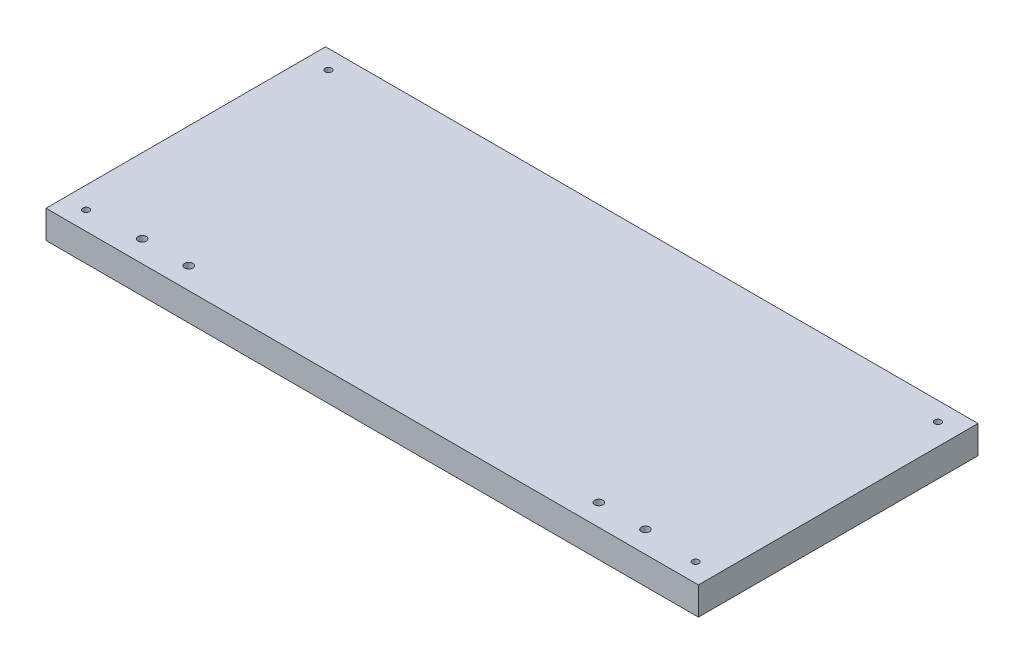
ISO-10303-21;
HEADER;
FILE_DESCRIPTION(('STEP AP214'),'2;1');
FILE_NAME('part.step','',(''),(''),'','','');
FILE_SCHEMA(('AUTOMOTIVE_DESIGN { 1 0 10303 214 1 1 1 1 }'));
ENDSEC;
DATA;
#1=APPLICATION_CONTEXT('core data for automotive mechanical design processes');
#2=APPLICATION_PROTOCOL_DEFINITION('international standard','automotive_design',2000,#1);
#3=PRODUCT_CONTEXT('',#1,'mechanical');
#4=PRODUCT('Part','Part','',(#3));
#5=PRODUCT_RELATED_PRODUCT_CATEGORY('part','',(#4));
#6=PRODUCT_DEFINITION_FORMATION('','',#4);
#7=PRODUCT_DEFINITION_CONTEXT('part definition',#1,'design');
#8=PRODUCT_DEFINITION('design','',#6,#7);
#9=PRODUCT_DEFINITION_SHAPE('','',#8);
#10=(LENGTH_UNIT() NAMED_UNIT(*) SI_UNIT(.MILLI.,.METRE.));
#11=(NAMED_UNIT(*) PLANE_ANGLE_UNIT() SI_UNIT($,.RADIAN.));
#12=(NAMED_UNIT(*) SI_UNIT($,.STERADIAN.) SOLID_ANGLE_UNIT());
#13=UNCERTAINTY_MEASURE_WITH_UNIT(LENGTH_MEASURE(1.E-05),#10,'distance_accuracy_value','');
#14=(GEOMETRIC_REPRESENTATION_CONTEXT(3) GLOBAL_UNCERTAINTY_ASSIGNED_CONTEXT((#13)) GLOBAL_UNIT_ASSIGNED_CONTEXT((#10,
#11,#12)) REPRESENTATION_CONTEXT('',''));
#15=CARTESIAN_POINT('',(0.,0.,0.));
#16=DIRECTION('',(0.,0.,1.));
#17=DIRECTION('',(1.,0.,0.));
#18=AXIS2_PLACEMENT_3D('',#15,#16,#17);
#19=CARTESIAN_POINT('',(0.,15.,0.));
#20=DIRECTION('',(0.,1.,0.));
#21=DIRECTION('',(0.,0.,1.));
#22=AXIS2_PLACEMENT_3D('',#19,#20,#21);
#23=PLANE('',#22);
#24=CARTESIAN_POINT('',(110.,15.,63.4000000000001));
#25=DIRECTION('',(0.,1.,0.));
#26=DIRECTION('',(0.,0.,1.));
#27=AXIS2_PLACEMENT_3D('',#24,#25,#26);
#28=CIRCLE('',#27,2.20000000000001);
#29=CARTESIAN_POINT('',(110.,15.,65.6000000000002));
#30=VERTEX_POINT('',#29);
#31=EDGE_CURVE('E153',#30,#30,#28,.T.);
#32=ORIENTED_EDGE('',*,*,#31,.F.);
#33=EDGE_LOOP('',(#32));
#34=FACE_BOUND('',#33,.T.);
#35=CARTESIAN_POINT('',(135.,15.,63.4));
#36=DIRECTION('',(0.,1.,0.));
#37=DIRECTION('',(0.,0.,1.));
#38=AXIS2_PLACEMENT_3D('',#35,#36,#37);
#39=CIRCLE('',#38,2.20000000000001);
#40=CARTESIAN_POINT('',(135.,15.,65.6));
#41=VERTEX_POINT('',#40);
#42=EDGE_CURVE('E147',#41,#41,#39,.T.);
#43=ORIENTED_EDGE('',*,*,#42,.F.);
#44=EDGE_LOOP('',(#43));
#45=FACE_BOUND('',#44,.T.);
#46=CARTESIAN_POINT('',(-110.,15.,63.4));
#47=DIRECTION('',(0.,1.,0.));
#48=DIRECTION('',(0.,0.,1.));
#49=AXIS2_PLACEMENT_3D('',#46,#47,#48);
#50=CIRCLE('',#49,2.20000000000001);
#51=CARTESIAN_POINT('',(-110.,15.,65.6));
#52=VERTEX_POINT('',#51);
#53=EDGE_CURVE('E141',#52,#52,#50,.T.);
#54=ORIENTED_EDGE('',*,*,#53,.F.);
#55=EDGE_LOOP('',(#54));
#56=FACE_BOUND('',#55,.T.);
#57=CARTESIAN_POINT('',(-135.,15.,63.4));
#58=DIRECTION('',(0.,1.,0.));
#59=DIRECTION('',(0.,0.,1.));
#60=AXIS2_PLACEMENT_3D('',#57,#58,#59);
#61=CIRCLE('',#60,2.20000000000001);
#62=CARTESIAN_POINT('',(-135.,15.,65.6));
#63=VERTEX_POINT('',#62);
#64=EDGE_CURVE('E135',#63,#63,#61,.T.);
#65=ORIENTED_EDGE('',*,*,#64,.F.);
#66=EDGE_LOOP('',(#65));
#67=FACE_BOUND('',#66,.T.);
#68=CARTESIAN_POINT('',(-163.5,15.,65.));
#69=DIRECTION('',(0.,1.,0.));
#70=DIRECTION('',(0.,0.,1.));
#71=AXIS2_PLACEMENT_3D('',#68,#69,#70);
#72=CIRCLE('',#71,1.75000000000001);
#73=CARTESIAN_POINT('',(-163.5,15.,66.75));
#74=VERTEX_POINT('',#73);
#75=EDGE_CURVE('E120',#74,#74,#72,.T.);
#76=ORIENTED_EDGE('',*,*,#75,.F.);
#77=EDGE_LOOP('',(#76));
#78=FACE_BOUND('',#77,.T.);
#79=CARTESIAN_POINT('',(163.5,15.,-65.));
#80=DIRECTION('',(0.,1.,0.));
#81=DIRECTION('',(0.,0.,1.));
#82=AXIS2_PLACEMENT_3D('',#79,#80,#81);
#83=CIRCLE('',#82,1.75000000000001);
#84=CARTESIAN_POINT('',(163.5,15.,-63.25));
#85=VERTEX_POINT('',#84);
#86=EDGE_CURVE('E99',#85,#85,#83,.T.);
#87=ORIENTED_EDGE('',*,*,#86,.F.);
#88=EDGE_LOOP('',(#87));
#89=FACE_BOUND('',#88,.T.);
#90=DIRECTION('',(0.,0.,-1.));
#91=VECTOR('',#90,1.);
#92=CARTESIAN_POINT('',(175.,15.,-75.));
#93=LINE('',#92,#91);
#94=CARTESIAN_POINT('',(175.,15.,75.));
#95=VERTEX_POINT('',#94);
#96=CARTESIAN_POINT('',(175.,15.,-75.));
#97=VERTEX_POINT('',#96);
#98=EDGE_CURVE('E84',#95,#97,#93,.T.);
#99=ORIENTED_EDGE('',*,*,#98,.T.);
#100=DIRECTION('',(-1.,0.,0.));
#101=VECTOR('',#100,1.);
#102=CARTESIAN_POINT('',(-175.,15.,-75.));
#103=LINE('',#102,#101);
#104=CARTESIAN_POINT('',(-175.,15.,-75.));
#105=VERTEX_POINT('',#104);
#106=EDGE_CURVE('E79',#97,#105,#103,.T.);
#107=ORIENTED_EDGE('',*,*,#106,.T.);
#108=DIRECTION('',(0.,0.,1.));
#109=VECTOR('',#108,1.);
#110=CARTESIAN_POINT('',(-175.,15.,-75.));
#111=LINE('',#110,#109);
#112=CARTESIAN_POINT('',(-175.,15.,75.));
#113=VERTEX_POINT('',#112);
#114=EDGE_CURVE('E82',#105,#113,#111,.T.);
#115=ORIENTED_EDGE('',*,*,#114,.T.);
#116=DIRECTION('',(1.,0.,0.));
#117=VECTOR('',#116,1.);
#118=CARTESIAN_POINT('',(-175.,15.,75.));
#119=LINE('',#118,#117);
#120=EDGE_CURVE('E49',#113,#95,#119,.T.);
#121=ORIENTED_EDGE('',*,*,#120,.T.);
#122=EDGE_LOOP('',(#99,#107,#115,#121));
#123=FACE_BOUND('',#122,.T.);
#124=CARTESIAN_POINT('',(163.5,15.,65.));
#125=DIRECTION('',(0.,1.,0.));
#126=DIRECTION('',(0.,0.,1.));
#127=AXIS2_PLACEMENT_3D('',#124,#125,#126);
#128=CIRCLE('',#127,1.75000000000001);
#129=CARTESIAN_POINT('',(163.5,15.,66.75));
#130=VERTEX_POINT('',#129);
#131=EDGE_CURVE('E114',#130,#130,#128,.T.);
#132=ORIENTED_EDGE('',*,*,#131,.F.);
#133=EDGE_LOOP('',(#132));
#134=FACE_BOUND('',#133,.T.);
#135=CARTESIAN_POINT('',(-163.5,15.,-65.));
#136=DIRECTION('',(0.,1.,0.));
#137=DIRECTION('',(0.,0.,1.));
#138=AXIS2_PLACEMENT_3D('',#135,#136,#137);
#139=CIRCLE('',#138,1.75000000000001);
#140=CARTESIAN_POINT('',(-163.5,15.,-63.25));
#141=VERTEX_POINT('',#140);
#142=EDGE_CURVE('E126',#141,#141,#139,.T.);
#143=ORIENTED_EDGE('',*,*,#142,.F.);
#144=EDGE_LOOP('',(#143));
#145=FACE_BOUND('',#144,.T.);
#146=ADVANCED_FACE('F32',(#34,#45,#56,#67,#78,#89,#123,#134,#145),#23,.T.);
#147=CARTESIAN_POINT('',(0.,0.,0.));
#148=DIRECTION('',(0.,1.,0.));
#149=DIRECTION('',(0.,0.,1.));
#150=AXIS2_PLACEMENT_3D('',#147,#148,#149);
#151=PLANE('',#150);
#152=CARTESIAN_POINT('',(110.,0.,63.4000000000001));
#153=DIRECTION('',(0.,1.,0.));
#154=DIRECTION('',(0.,0.,1.));
#155=AXIS2_PLACEMENT_3D('',#152,#153,#154);
#156=CIRCLE('',#155,2.20000000000001);
#157=CARTESIAN_POINT('',(110.,0.,65.6000000000002));
#158=VERTEX_POINT('',#157);
#159=EDGE_CURVE('E150',#158,#158,#156,.T.);
#160=ORIENTED_EDGE('',*,*,#159,.T.);
#161=EDGE_LOOP('',(#160));
#162=FACE_BOUND('',#161,.T.);
#163=CARTESIAN_POINT('',(135.,0.,63.4));
#164=DIRECTION('',(0.,1.,0.));
#165=DIRECTION('',(0.,0.,1.));
#166=AXIS2_PLACEMENT_3D('',#163,#164,#165);
#167=CIRCLE('',#166,2.20000000000001);
#168=CARTESIAN_POINT('',(135.,0.,65.6));
#169=VERTEX_POINT('',#168);
#170=EDGE_CURVE('E144',#169,#169,#167,.T.);
#171=ORIENTED_EDGE('',*,*,#170,.T.);
#172=EDGE_LOOP('',(#171));
#173=FACE_BOUND('',#172,.T.);
#174=CARTESIAN_POINT('',(-110.,0.,63.4));
#175=DIRECTION('',(0.,1.,0.));
#176=DIRECTION('',(0.,0.,1.));
#177=AXIS2_PLACEMENT_3D('',#174,#175,#176);
#178=CIRCLE('',#177,2.20000000000001);
#179=CARTESIAN_POINT('',(-110.,0.,65.6));
#180=VERTEX_POINT('',#179);
#181=EDGE_CURVE('E138',#180,#180,#178,.T.);
#182=ORIENTED_EDGE('',*,*,#181,.T.);
#183=EDGE_LOOP('',(#182));
#184=FACE_BOUND('',#183,.T.);
#185=CARTESIAN_POINT('',(-135.,0.,63.4));
#186=DIRECTION('',(0.,1.,0.));
#187=DIRECTION('',(0.,0.,1.));
#188=AXIS2_PLACEMENT_3D('',#185,#186,#187);
#189=CIRCLE('',#188,2.20000000000001);
#190=CARTESIAN_POINT('',(-135.,0.,65.6));
#191=VERTEX_POINT('',#190);
#192=EDGE_CURVE('E132',#191,#191,#189,.T.);
#193=ORIENTED_EDGE('',*,*,#192,.T.);
#194=EDGE_LOOP('',(#193));
#195=FACE_BOUND('',#194,.T.);
#196=CARTESIAN_POINT('',(-163.5,0.,65.));
#197=DIRECTION('',(0.,1.,0.));
#198=DIRECTION('',(0.,0.,1.));
#199=AXIS2_PLACEMENT_3D('',#196,#197,#198);
#200=CIRCLE('',#199,1.75000000000001);
#201=CARTESIAN_POINT('',(-163.5,0.,66.75));
#202=VERTEX_POINT('',#201);
#203=EDGE_CURVE('E123',#202,#202,#200,.T.);
#204=ORIENTED_EDGE('',*,*,#203,.T.);
#205=EDGE_LOOP('',(#204));
#206=FACE_BOUND('',#205,.T.);
#207=CARTESIAN_POINT('',(163.5,0.,-65.));
#208=DIRECTION('',(0.,1.,0.));
#209=DIRECTION('',(0.,0.,1.));
#210=AXIS2_PLACEMENT_3D('',#207,#208,#209);
#211=CIRCLE('',#210,1.75000000000001);
#212=CARTESIAN_POINT('',(163.5,0.,-63.25));
#213=VERTEX_POINT('',#212);
#214=EDGE_CURVE('E111',#213,#213,#211,.T.);
#215=ORIENTED_EDGE('',*,*,#214,.T.);
#216=EDGE_LOOP('',(#215));
#217=FACE_BOUND('',#216,.T.);
#218=DIRECTION('',(0.,0.,-1.));
#219=VECTOR('',#218,1.);
#220=CARTESIAN_POINT('',(175.,0.,-75.));
#221=LINE('',#220,#219);
#222=CARTESIAN_POINT('',(175.,0.,75.));
#223=VERTEX_POINT('',#222);
#224=CARTESIAN_POINT('',(175.,0.,-75.));
#225=VERTEX_POINT('',#224);
#226=EDGE_CURVE('E96',#223,#225,#221,.T.);
#227=ORIENTED_EDGE('',*,*,#226,.F.);
#228=DIRECTION('',(1.,0.,0.));
#229=VECTOR('',#228,1.);
#230=CARTESIAN_POINT('',(-175.,0.,75.));
#231=LINE('',#230,#229);
#232=CARTESIAN_POINT('',(-175.,0.,75.));
#233=VERTEX_POINT('',#232);
#234=EDGE_CURVE('E72',#233,#223,#231,.T.);
#235=ORIENTED_EDGE('',*,*,#234,.F.);
#236=DIRECTION('',(0.,0.,1.));
#237=VECTOR('',#236,1.);
#238=CARTESIAN_POINT('',(-175.,0.,-75.));
#239=LINE('',#238,#237);
#240=CARTESIAN_POINT('',(-175.,0.,-75.));
#241=VERTEX_POINT('',#240);
#242=EDGE_CURVE('E66',#241,#233,#239,.T.);
#243=ORIENTED_EDGE('',*,*,#242,.F.);
#244=DIRECTION('',(-1.,0.,0.));
#245=VECTOR('',#244,1.);
#246=CARTESIAN_POINT('',(-175.,0.,-75.));
#247=LINE('',#246,#245);
#248=EDGE_CURVE('E88',#225,#241,#247,.T.);
#249=ORIENTED_EDGE('',*,*,#248,.F.);
#250=EDGE_LOOP('',(#227,#235,#243,#249));
#251=FACE_BOUND('',#250,.T.);
#252=CARTESIAN_POINT('',(163.5,0.,65.));
#253=DIRECTION('',(0.,1.,0.));
#254=DIRECTION('',(0.,0.,1.));
#255=AXIS2_PLACEMENT_3D('',#252,#253,#254);
#256=CIRCLE('',#255,1.75000000000001);
#257=CARTESIAN_POINT('',(163.5,0.,66.75));
#258=VERTEX_POINT('',#257);
#259=EDGE_CURVE('E117',#258,#258,#256,.T.);
#260=ORIENTED_EDGE('',*,*,#259,.T.);
#261=EDGE_LOOP('',(#260));
#262=FACE_BOUND('',#261,.T.);
#263=CARTESIAN_POINT('',(-163.5,0.,-65.));
#264=DIRECTION('',(0.,1.,0.));
#265=DIRECTION('',(0.,0.,1.));
#266=AXIS2_PLACEMENT_3D('',#263,#264,#265);
#267=CIRCLE('',#266,1.75000000000001);
#268=CARTESIAN_POINT('',(-163.5,0.,-63.25));
#269=VERTEX_POINT('',#268);
#270=EDGE_CURVE('E129',#269,#269,#267,.T.);
#271=ORIENTED_EDGE('',*,*,#270,.T.);
#272=EDGE_LOOP('',(#271));
#273=FACE_BOUND('',#272,.T.);
#274=ADVANCED_FACE('F107',(#162,#173,#184,#195,#206,#217,#251,#262,#273),#151,.F.);
#275=CARTESIAN_POINT('',(175.,15.,-75.));
#276=DIRECTION('',(-1.,0.,0.));
#277=DIRECTION('',(0.,0.,1.));
#278=AXIS2_PLACEMENT_3D('',#275,#276,#277);
#279=PLANE('',#278);
#280=ORIENTED_EDGE('',*,*,#226,.T.);
#281=DIRECTION('',(0.,-1.,0.));
#282=VECTOR('',#281,1.);
#283=CARTESIAN_POINT('',(175.,15.,-75.));
#284=LINE('',#283,#282);
#285=EDGE_CURVE('E11',#97,#225,#284,.T.);
#286=ORIENTED_EDGE('',*,*,#285,.F.);
#287=ORIENTED_EDGE('',*,*,#98,.F.);
#288=DIRECTION('',(0.,-1.,0.));
#289=VECTOR('',#288,1.);
#290=CARTESIAN_POINT('',(175.,15.,75.));
#291=LINE('',#290,#289);
#292=EDGE_CURVE('E92',#95,#223,#291,.T.);
#293=ORIENTED_EDGE('',*,*,#292,.T.);
#294=EDGE_LOOP('',(#280,#286,#287,#293));
#295=FACE_BOUND('',#294,.T.);
#296=ADVANCED_FACE('F34',(#295),#279,.F.);
#297=CARTESIAN_POINT('',(-175.,15.,-75.));
#298=DIRECTION('',(0.,0.,1.));
#299=DIRECTION('',(1.,0.,0.));
#300=AXIS2_PLACEMENT_3D('',#297,#298,#299);
#301=PLANE('',#300);
#302=ORIENTED_EDGE('',*,*,#248,.T.);
#303=DIRECTION('',(0.,-1.,0.));
#304=VECTOR('',#303,1.);
#305=CARTESIAN_POINT('',(-175.,15.,-75.));
#306=LINE('',#305,#304);
#307=EDGE_CURVE('E41',#105,#241,#306,.T.);
#308=ORIENTED_EDGE('',*,*,#307,.F.);
#309=ORIENTED_EDGE('',*,*,#106,.F.);
#310=ORIENTED_EDGE('',*,*,#285,.T.);
#311=EDGE_LOOP('',(#302,#308,#309,#310));
#312=FACE_BOUND('',#311,.T.);
#313=ADVANCED_FACE('F87',(#312),#301,.F.);
#314=CARTESIAN_POINT('',(-175.,15.,-75.));
#315=DIRECTION('',(1.,0.,0.));
#316=DIRECTION('',(0.,0.,-1.));
#317=AXIS2_PLACEMENT_3D('',#314,#315,#316);
#318=PLANE('',#317);
#319=ORIENTED_EDGE('',*,*,#242,.T.);
#320=DIRECTION('',(0.,-1.,0.));
#321=VECTOR('',#320,1.);
#322=CARTESIAN_POINT('',(-175.,15.,75.));
#323=LINE('',#322,#321);
#324=EDGE_CURVE('E89',#113,#233,#323,.T.);
#325=ORIENTED_EDGE('',*,*,#324,.F.);
#326=ORIENTED_EDGE('',*,*,#114,.F.);
#327=ORIENTED_EDGE('',*,*,#307,.T.);
#328=EDGE_LOOP('',(#319,#325,#326,#327));
#329=FACE_BOUND('',#328,.T.);
#330=ADVANCED_FACE('F90',(#329),#318,.F.);
#331=CARTESIAN_POINT('',(-175.,15.,75.));
#332=DIRECTION('',(0.,0.,-1.));
#333=DIRECTION('',(-1.,0.,0.));
#334=AXIS2_PLACEMENT_3D('',#331,#332,#333);
#335=PLANE('',#334);
#336=ORIENTED_EDGE('',*,*,#234,.T.);
#337=ORIENTED_EDGE('',*,*,#292,.F.);
#338=ORIENTED_EDGE('',*,*,#120,.F.);
#339=ORIENTED_EDGE('',*,*,#324,.T.);
#340=EDGE_LOOP('',(#336,#337,#338,#339));
#341=FACE_BOUND('',#340,.T.);
#342=ADVANCED_FACE('F104',(#341),#335,.F.);
#343=CARTESIAN_POINT('',(163.5,15.,-65.));
#344=DIRECTION('',(0.,-1.,0.));
#345=DIRECTION('',(0.,0.,-1.));
#346=AXIS2_PLACEMENT_3D('',#343,#344,#345);
#347=CYLINDRICAL_SURFACE('',#346,1.75000000000001);
#348=ORIENTED_EDGE('',*,*,#86,.T.);
#349=EDGE_LOOP('',(#348));
#350=FACE_BOUND('',#349,.T.);
#351=ORIENTED_EDGE('',*,*,#214,.F.);
#352=EDGE_LOOP('',(#351));
#353=FACE_BOUND('',#352,.T.);
#354=ADVANCED_FACE('F181',(#350,#353),#347,.F.);
#355=CARTESIAN_POINT('',(163.5,15.,65.));
#356=DIRECTION('',(0.,-1.,0.));
#357=DIRECTION('',(0.,0.,-1.));
#358=AXIS2_PLACEMENT_3D('',#355,#356,#357);
#359=CYLINDRICAL_SURFACE('',#358,1.75000000000001);
#360=ORIENTED_EDGE('',*,*,#131,.T.);
#361=EDGE_LOOP('',(#360));
#362=FACE_BOUND('',#361,.T.);
#363=ORIENTED_EDGE('',*,*,#259,.F.);
#364=EDGE_LOOP('',(#363));
#365=FACE_BOUND('',#364,.T.);
#366=ADVANCED_FACE('F184',(#362,#365),#359,.F.);
#367=CARTESIAN_POINT('',(-163.5,15.,65.));
#368=DIRECTION('',(0.,-1.,0.));
#369=DIRECTION('',(0.,0.,-1.));
#370=AXIS2_PLACEMENT_3D('',#367,#368,#369);
#371=CYLINDRICAL_SURFACE('',#370,1.75000000000001);
#372=ORIENTED_EDGE('',*,*,#75,.T.);
#373=EDGE_LOOP('',(#372));
#374=FACE_BOUND('',#373,.T.);
#375=ORIENTED_EDGE('',*,*,#203,.F.);
#376=EDGE_LOOP('',(#375));
#377=FACE_BOUND('',#376,.T.);
#378=ADVANCED_FACE('F220',(#374,#377),#371,.F.);
#379=CARTESIAN_POINT('',(-163.5,15.,-65.));
#380=DIRECTION('',(0.,-1.,0.));
#381=DIRECTION('',(0.,0.,-1.));
#382=AXIS2_PLACEMENT_3D('',#379,#380,#381);
#383=CYLINDRICAL_SURFACE('',#382,1.75000000000001);
#384=ORIENTED_EDGE('',*,*,#142,.T.);
#385=EDGE_LOOP('',(#384));
#386=FACE_BOUND('',#385,.T.);
#387=ORIENTED_EDGE('',*,*,#270,.F.);
#388=EDGE_LOOP('',(#387));
#389=FACE_BOUND('',#388,.T.);
#390=ADVANCED_FACE('F228',(#386,#389),#383,.F.);
#391=CARTESIAN_POINT('',(-135.,0.,63.4));
#392=DIRECTION('',(0.,1.,0.));
#393=DIRECTION('',(0.,0.,1.));
#394=AXIS2_PLACEMENT_3D('',#391,#392,#393);
#395=CYLINDRICAL_SURFACE('',#394,2.20000000000001);
#396=ORIENTED_EDGE('',*,*,#192,.F.);
#397=EDGE_LOOP('',(#396));
#398=FACE_BOUND('',#397,.T.);
#399=ORIENTED_EDGE('',*,*,#64,.T.);
#400=EDGE_LOOP('',(#399));
#401=FACE_BOUND('',#400,.T.);
#402=ADVANCED_FACE('F236',(#398,#401),#395,.F.);
#403=CARTESIAN_POINT('',(-110.,0.,63.4));
#404=DIRECTION('',(0.,1.,0.));
#405=DIRECTION('',(0.,0.,1.));
#406=AXIS2_PLACEMENT_3D('',#403,#404,#405);
#407=CYLINDRICAL_SURFACE('',#406,2.20000000000001);
#408=ORIENTED_EDGE('',*,*,#181,.F.);
#409=EDGE_LOOP('',(#408));
#410=FACE_BOUND('',#409,.T.);
#411=ORIENTED_EDGE('',*,*,#53,.T.);
#412=EDGE_LOOP('',(#411));
#413=FACE_BOUND('',#412,.T.);
#414=ADVANCED_FACE('F245',(#410,#413),#407,.F.);
#415=CARTESIAN_POINT('',(135.,0.,63.4));
#416=DIRECTION('',(0.,1.,0.));
#417=DIRECTION('',(0.,0.,1.));
#418=AXIS2_PLACEMENT_3D('',#415,#416,#417);
#419=CYLINDRICAL_SURFACE('',#418,2.20000000000001);
#420=ORIENTED_EDGE('',*,*,#170,.F.);
#421=EDGE_LOOP('',(#420));
#422=FACE_BOUND('',#421,.T.);
#423=ORIENTED_EDGE('',*,*,#42,.T.);
#424=EDGE_LOOP('',(#423));
#425=FACE_BOUND('',#424,.T.);
#426=ADVANCED_FACE('F164',(#422,#425),#419,.F.);
#427=CARTESIAN_POINT('',(110.,0.,63.4000000000001));
#428=DIRECTION('',(0.,1.,0.));
#429=DIRECTION('',(0.,0.,1.));
#430=AXIS2_PLACEMENT_3D('',#427,#428,#429);
#431=CYLINDRICAL_SURFACE('',#430,2.20000000000001);
#432=ORIENTED_EDGE('',*,*,#159,.F.);
#433=EDGE_LOOP('',(#432));
#434=FACE_BOUND('',#433,.T.);
#435=ORIENTED_EDGE('',*,*,#31,.T.);
#436=EDGE_LOOP('',(#435));
#437=FACE_BOUND('',#436,.T.);
#438=ADVANCED_FACE('F161',(#434,#437),#431,.F.);
#439=CLOSED_SHELL('',(#146,#274,#296,#313,#330,#342,#354,#366,#378,#390,#402,#414,#426,#438));
#440=MANIFOLD_SOLID_BREP('B2',#439);
#441=ADVANCED_BREP_SHAPE_REPRESENTATION('',(#18,#440),#14);
#442=SHAPE_DEFINITION_REPRESENTATION(#9,#441);
ENDSEC;
END-ISO-10303-21;
